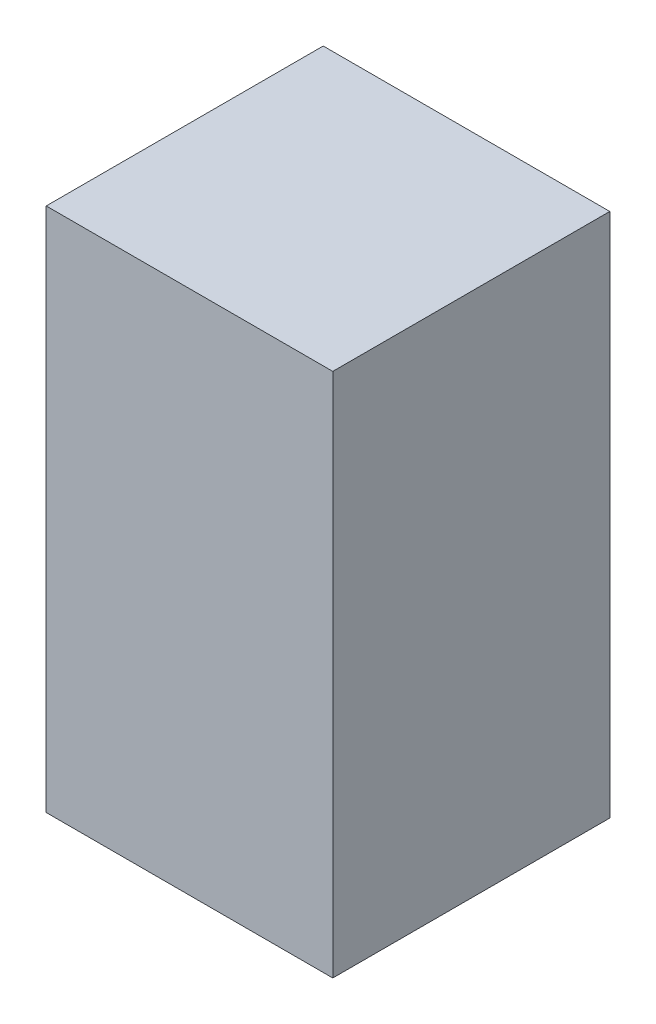
ISO-10303-21;
HEADER;
FILE_DESCRIPTION(('STEP AP214'),'2;1');
FILE_NAME('part.step','',(''),(''),'','','');
FILE_SCHEMA(('AUTOMOTIVE_DESIGN { 1 0 10303 214 1 1 1 1 }'));
ENDSEC;
DATA;
#1=APPLICATION_CONTEXT('core data for automotive mechanical design processes');
#2=APPLICATION_PROTOCOL_DEFINITION('international standard','automotive_design',2000,#1);
#3=PRODUCT_CONTEXT('',#1,'mechanical');
#4=PRODUCT('Part','Part','',(#3));
#5=PRODUCT_RELATED_PRODUCT_CATEGORY('part','',(#4));
#6=PRODUCT_DEFINITION_FORMATION('','',#4);
#7=PRODUCT_DEFINITION_CONTEXT('part definition',#1,'design');
#8=PRODUCT_DEFINITION('design','',#6,#7);
#9=PRODUCT_DEFINITION_SHAPE('','',#8);
#10=(LENGTH_UNIT() NAMED_UNIT(*) SI_UNIT(.MILLI.,.METRE.));
#11=(NAMED_UNIT(*) PLANE_ANGLE_UNIT() SI_UNIT($,.RADIAN.));
#12=(NAMED_UNIT(*) SI_UNIT($,.STERADIAN.) SOLID_ANGLE_UNIT());
#13=UNCERTAINTY_MEASURE_WITH_UNIT(LENGTH_MEASURE(1.E-05),#10,'distance_accuracy_value','');
#14=(GEOMETRIC_REPRESENTATION_CONTEXT(3) GLOBAL_UNCERTAINTY_ASSIGNED_CONTEXT((#13)) GLOBAL_UNIT_ASSIGNED_CONTEXT((#10,
#11,#12)) REPRESENTATION_CONTEXT('',''));
#15=CARTESIAN_POINT('',(0.,0.,0.));
#16=DIRECTION('',(0.,0.,1.));
#17=DIRECTION('',(1.,0.,0.));
#18=AXIS2_PLACEMENT_3D('',#15,#16,#17);
#19=CARTESIAN_POINT('',(0.,2.75,0.));
#20=DIRECTION('',(1.,0.,0.));
#21=DIRECTION('',(0.,0.,-1.));
#22=AXIS2_PLACEMENT_3D('',#19,#20,#21);
#23=PLANE('',#22);
#24=DIRECTION('',(0.,0.,1.));
#25=VECTOR('',#24,1.);
#26=CARTESIAN_POINT('',(0.,0.,0.));
#27=LINE('',#26,#25);
#28=CARTESIAN_POINT('',(0.,0.,-1.45));
#29=VERTEX_POINT('',#28);
#30=CARTESIAN_POINT('',(0.,0.,0.));
#31=VERTEX_POINT('',#30);
#32=EDGE_CURVE('E98',#29,#31,#27,.T.);
#33=ORIENTED_EDGE('',*,*,#32,.T.);
#34=DIRECTION('',(0.,-1.,0.));
#35=VECTOR('',#34,1.);
#36=CARTESIAN_POINT('',(0.,2.75,0.));
#37=LINE('',#36,#35);
#38=CARTESIAN_POINT('',(0.,2.75,0.));
#39=VERTEX_POINT('',#38);
#40=EDGE_CURVE('E11',#39,#31,#37,.T.);
#41=ORIENTED_EDGE('',*,*,#40,.F.);
#42=DIRECTION('',(0.,0.,1.));
#43=VECTOR('',#42,1.);
#44=CARTESIAN_POINT('',(0.,2.75,0.));
#45=LINE('',#44,#43);
#46=CARTESIAN_POINT('',(0.,2.75,-1.45));
#47=VERTEX_POINT('',#46);
#48=EDGE_CURVE('E86',#47,#39,#45,.T.);
#49=ORIENTED_EDGE('',*,*,#48,.F.);
#50=DIRECTION('',(0.,-1.,0.));
#51=VECTOR('',#50,1.);
#52=CARTESIAN_POINT('',(0.,2.75,-1.45));
#53=LINE('',#52,#51);
#54=EDGE_CURVE('E94',#47,#29,#53,.T.);
#55=ORIENTED_EDGE('',*,*,#54,.T.);
#56=EDGE_LOOP('',(#33,#41,#49,#55));
#57=FACE_BOUND('',#56,.T.);
#58=ADVANCED_FACE('F35',(#57),#23,.F.);
#59=CARTESIAN_POINT('',(0.,2.75,0.));
#60=DIRECTION('',(0.,0.,-1.));
#61=DIRECTION('',(-1.,0.,0.));
#62=AXIS2_PLACEMENT_3D('',#59,#60,#61);
#63=PLANE('',#62);
#64=DIRECTION('',(1.,0.,0.));
#65=VECTOR('',#64,1.);
#66=CARTESIAN_POINT('',(0.,0.,0.));
#67=LINE('',#66,#65);
#68=CARTESIAN_POINT('',(1.5,0.,0.));
#69=VERTEX_POINT('',#68);
#70=EDGE_CURVE('E90',#31,#69,#67,.T.);
#71=ORIENTED_EDGE('',*,*,#70,.T.);
#72=DIRECTION('',(0.,-1.,0.));
#73=VECTOR('',#72,1.);
#74=CARTESIAN_POINT('',(1.5,2.75,0.));
#75=LINE('',#74,#73);
#76=CARTESIAN_POINT('',(1.5,2.75,0.));
#77=VERTEX_POINT('',#76);
#78=EDGE_CURVE('E43',#77,#69,#75,.T.);
#79=ORIENTED_EDGE('',*,*,#78,.F.);
#80=DIRECTION('',(1.,0.,0.));
#81=VECTOR('',#80,1.);
#82=CARTESIAN_POINT('',(0.,2.75,0.));
#83=LINE('',#82,#81);
#84=EDGE_CURVE('E81',#39,#77,#83,.T.);
#85=ORIENTED_EDGE('',*,*,#84,.F.);
#86=ORIENTED_EDGE('',*,*,#40,.T.);
#87=EDGE_LOOP('',(#71,#79,#85,#86));
#88=FACE_BOUND('',#87,.T.);
#89=ADVANCED_FACE('F89',(#88),#63,.F.);
#90=CARTESIAN_POINT('',(1.5,2.75,0.));
#91=DIRECTION('',(-1.,0.,0.));
#92=DIRECTION('',(0.,0.,1.));
#93=AXIS2_PLACEMENT_3D('',#90,#91,#92);
#94=PLANE('',#93);
#95=DIRECTION('',(0.,0.,-1.));
#96=VECTOR('',#95,1.);
#97=CARTESIAN_POINT('',(1.5,0.,0.));
#98=LINE('',#97,#96);
#99=CARTESIAN_POINT('',(1.5,0.,-1.45));
#100=VERTEX_POINT('',#99);
#101=EDGE_CURVE('E68',#69,#100,#98,.T.);
#102=ORIENTED_EDGE('',*,*,#101,.T.);
#103=DIRECTION('',(0.,-1.,0.));
#104=VECTOR('',#103,1.);
#105=CARTESIAN_POINT('',(1.5,2.75,-1.45));
#106=LINE('',#105,#104);
#107=CARTESIAN_POINT('',(1.5,2.75,-1.45));
#108=VERTEX_POINT('',#107);
#109=EDGE_CURVE('E91',#108,#100,#106,.T.);
#110=ORIENTED_EDGE('',*,*,#109,.F.);
#111=DIRECTION('',(0.,0.,-1.));
#112=VECTOR('',#111,1.);
#113=CARTESIAN_POINT('',(1.5,2.75,0.));
#114=LINE('',#113,#112);
#115=EDGE_CURVE('E84',#77,#108,#114,.T.);
#116=ORIENTED_EDGE('',*,*,#115,.F.);
#117=ORIENTED_EDGE('',*,*,#78,.T.);
#118=EDGE_LOOP('',(#102,#110,#116,#117));
#119=FACE_BOUND('',#118,.T.);
#120=ADVANCED_FACE('F92',(#119),#94,.F.);
#121=CARTESIAN_POINT('',(0.,2.75,-1.45));
#122=DIRECTION('',(0.,0.,1.));
#123=DIRECTION('',(1.,0.,0.));
#124=AXIS2_PLACEMENT_3D('',#121,#122,#123);
#125=PLANE('',#124);
#126=DIRECTION('',(-1.,0.,0.));
#127=VECTOR('',#126,1.);
#128=CARTESIAN_POINT('',(0.,0.,-1.45));
#129=LINE('',#128,#127);
#130=EDGE_CURVE('E74',#100,#29,#129,.T.);
#131=ORIENTED_EDGE('',*,*,#130,.T.);
#132=ORIENTED_EDGE('',*,*,#54,.F.);
#133=DIRECTION('',(-1.,0.,0.));
#134=VECTOR('',#133,1.);
#135=CARTESIAN_POINT('',(0.,2.75,-1.45));
#136=LINE('',#135,#134);
#137=EDGE_CURVE('E51',#108,#47,#136,.T.);
#138=ORIENTED_EDGE('',*,*,#137,.F.);
#139=ORIENTED_EDGE('',*,*,#109,.T.);
#140=EDGE_LOOP('',(#131,#132,#138,#139));
#141=FACE_BOUND('',#140,.T.);
#142=ADVANCED_FACE('F105',(#141),#125,.F.);
#143=CARTESIAN_POINT('',(0.,2.75,0.));
#144=DIRECTION('',(0.,-1.,0.));
#145=DIRECTION('',(0.,0.,-1.));
#146=AXIS2_PLACEMENT_3D('',#143,#144,#145);
#147=PLANE('',#146);
#148=ORIENTED_EDGE('',*,*,#48,.T.);
#149=ORIENTED_EDGE('',*,*,#84,.T.);
#150=ORIENTED_EDGE('',*,*,#115,.T.);
#151=ORIENTED_EDGE('',*,*,#137,.T.);
#152=EDGE_LOOP('',(#148,#149,#150,#151));
#153=FACE_BOUND('',#152,.T.);
#154=ADVANCED_FACE('F82',(#153),#147,.F.);
#155=CARTESIAN_POINT('',(0.,0.,0.));
#156=DIRECTION('',(0.,-1.,0.));
#157=DIRECTION('',(0.,0.,-1.));
#158=AXIS2_PLACEMENT_3D('',#155,#156,#157);
#159=PLANE('',#158);
#160=ORIENTED_EDGE('',*,*,#32,.F.);
#161=ORIENTED_EDGE('',*,*,#130,.F.);
#162=ORIENTED_EDGE('',*,*,#101,.F.);
#163=ORIENTED_EDGE('',*,*,#70,.F.);
#164=EDGE_LOOP('',(#160,#161,#162,#163));
#165=FACE_BOUND('',#164,.T.);
#166=ADVANCED_FACE('F108',(#165),#159,.T.);
#167=CLOSED_SHELL('',(#58,#89,#120,#142,#154,#166));
#168=MANIFOLD_SOLID_BREP('B2',#167);
#169=ADVANCED_BREP_SHAPE_REPRESENTATION('',(#18,#168),#14);
#170=SHAPE_DEFINITION_REPRESENTATION(#9,#169);
ENDSEC;
END-ISO-10303-21;
